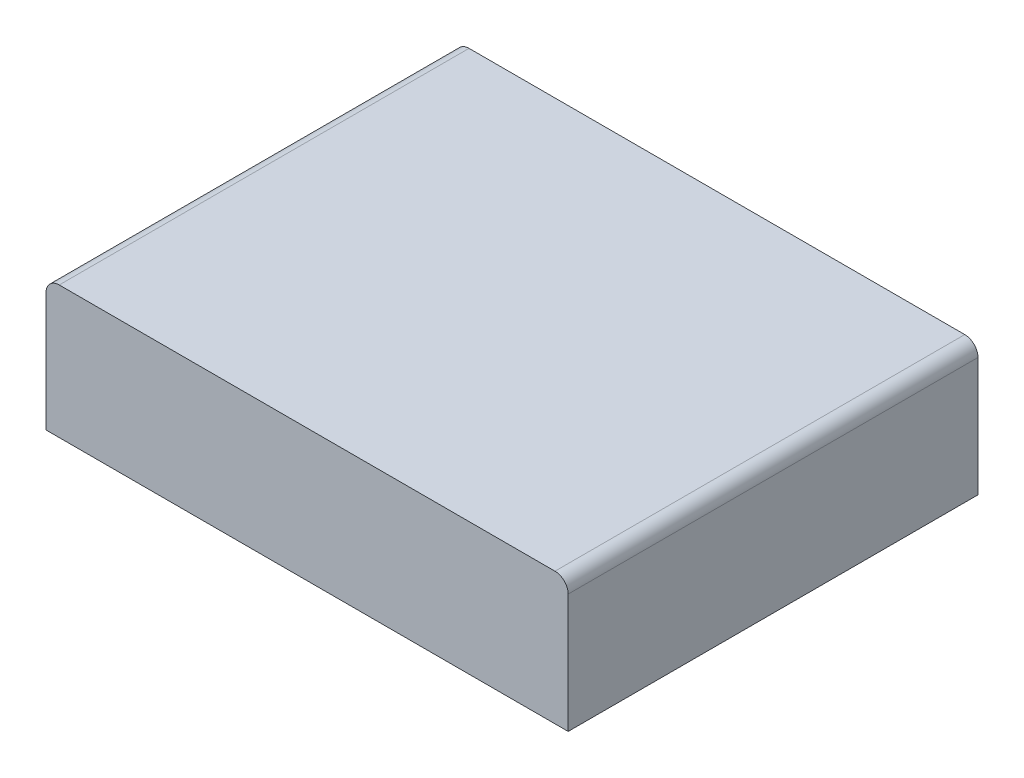
ISO-10303-21;
HEADER;
FILE_DESCRIPTION(('STEP AP214'),'2;1');
FILE_NAME('part.step','',(''),(''),'','','');
FILE_SCHEMA(('AUTOMOTIVE_DESIGN { 1 0 10303 214 1 1 1 1 }'));
ENDSEC;
DATA;
#1=APPLICATION_CONTEXT('core data for automotive mechanical design processes');
#2=APPLICATION_PROTOCOL_DEFINITION('international standard','automotive_design',2000,#1);
#3=PRODUCT_CONTEXT('',#1,'mechanical');
#4=PRODUCT('Part','Part','',(#3));
#5=PRODUCT_RELATED_PRODUCT_CATEGORY('part','',(#4));
#6=PRODUCT_DEFINITION_FORMATION('','',#4);
#7=PRODUCT_DEFINITION_CONTEXT('part definition',#1,'design');
#8=PRODUCT_DEFINITION('design','',#6,#7);
#9=PRODUCT_DEFINITION_SHAPE('','',#8);
#10=(LENGTH_UNIT() NAMED_UNIT(*) SI_UNIT(.MILLI.,.METRE.));
#11=(NAMED_UNIT(*) PLANE_ANGLE_UNIT() SI_UNIT($,.RADIAN.));
#12=(NAMED_UNIT(*) SI_UNIT($,.STERADIAN.) SOLID_ANGLE_UNIT());
#13=UNCERTAINTY_MEASURE_WITH_UNIT(LENGTH_MEASURE(1.E-05),#10,'distance_accuracy_value','');
#14=(GEOMETRIC_REPRESENTATION_CONTEXT(3) GLOBAL_UNCERTAINTY_ASSIGNED_CONTEXT((#13)) GLOBAL_UNIT_ASSIGNED_CONTEXT((#10,
#11,#12)) REPRESENTATION_CONTEXT('',''));
#15=CARTESIAN_POINT('',(0.,0.,0.));
#16=DIRECTION('',(0.,0.,1.));
#17=DIRECTION('',(1.,0.,0.));
#18=AXIS2_PLACEMENT_3D('',#15,#16,#17);
#19=CARTESIAN_POINT('',(-6.32168040793806,39.1976983767566,241.582525583809));
#20=DIRECTION('',(0.,0.,1.));
#21=DIRECTION('',(1.,0.,0.));
#22=AXIS2_PLACEMENT_3D('',#19,#20,#21);
#23=CYLINDRICAL_SURFACE('',#22,0.0508);
#24=CARTESIAN_POINT('',(-6.32168040793806,39.1976983767566,240.795125583809));
#25=DIRECTION('',(0.,0.,1.));
#26=DIRECTION('',(1.,0.,0.));
#27=AXIS2_PLACEMENT_3D('',#24,#25,#26);
#28=CIRCLE('',#27,0.0508);
#29=CARTESIAN_POINT('',(-6.32168040793806,39.2484983767566,240.795125583809));
#30=VERTEX_POINT('',#29);
#31=CARTESIAN_POINT('',(-6.37248040793806,39.1976983767566,240.795125583809));
#32=VERTEX_POINT('',#31);
#33=EDGE_CURVE('E125',#30,#32,#28,.T.);
#34=ORIENTED_EDGE('',*,*,#33,.T.);
#35=DIRECTION('',(0.,0.,-1.));
#36=VECTOR('',#35,1.);
#37=CARTESIAN_POINT('',(-6.37248040793806,39.1976983767566,242.36992558381));
#38=LINE('',#37,#36);
#39=CARTESIAN_POINT('',(-6.37248040793806,39.1976983767566,242.36992558381));
#40=VERTEX_POINT('',#39);
#41=EDGE_CURVE('E108',#32,#40,#38,.F.);
#42=ORIENTED_EDGE('',*,*,#41,.T.);
#43=CARTESIAN_POINT('',(-6.32168040793806,39.1976983767566,242.36992558381));
#44=DIRECTION('',(0.,0.,1.));
#45=DIRECTION('',(1.,0.,0.));
#46=AXIS2_PLACEMENT_3D('',#43,#44,#45);
#47=CIRCLE('',#46,0.0508);
#48=CARTESIAN_POINT('',(-6.32168040793806,39.2484983767566,242.36992558381));
#49=VERTEX_POINT('',#48);
#50=EDGE_CURVE('E20',#40,#49,#47,.F.);
#51=ORIENTED_EDGE('',*,*,#50,.T.);
#52=DIRECTION('',(0.,0.,-1.));
#53=VECTOR('',#52,1.);
#54=CARTESIAN_POINT('',(-6.32168040793806,39.2484983767566,241.582525583809));
#55=LINE('',#54,#53);
#56=EDGE_CURVE('E104',#49,#30,#55,.T.);
#57=ORIENTED_EDGE('',*,*,#56,.T.);
#58=EDGE_LOOP('',(#34,#42,#51,#57));
#59=FACE_BOUND('',#58,.T.);
#60=ADVANCED_FACE('F17',(#59),#23,.T.);
#61=CARTESIAN_POINT('',(-4.41668040793807,39.1976983767566,241.582525583809));
#62=DIRECTION('',(0.,0.,-1.));
#63=DIRECTION('',(-1.,0.,0.));
#64=AXIS2_PLACEMENT_3D('',#61,#62,#63);
#65=CYLINDRICAL_SURFACE('',#64,0.0508);
#66=CARTESIAN_POINT('',(-4.41668040793807,39.1976983767566,242.36992558381));
#67=DIRECTION('',(0.,0.,-1.));
#68=DIRECTION('',(-1.,0.,0.));
#69=AXIS2_PLACEMENT_3D('',#66,#67,#68);
#70=CIRCLE('',#69,0.0508);
#71=CARTESIAN_POINT('',(-4.41668040793807,39.2484983767566,242.36992558381));
#72=VERTEX_POINT('',#71);
#73=CARTESIAN_POINT('',(-4.36588040793806,39.1976983767566,242.36992558381));
#74=VERTEX_POINT('',#73);
#75=EDGE_CURVE('E113',#72,#74,#70,.T.);
#76=ORIENTED_EDGE('',*,*,#75,.T.);
#77=DIRECTION('',(0.,0.,1.));
#78=VECTOR('',#77,1.);
#79=CARTESIAN_POINT('',(-4.36588040793806,39.1976983767566,242.36992558381));
#80=LINE('',#79,#78);
#81=CARTESIAN_POINT('',(-4.36588040793806,39.1976983767566,240.795125583809));
#82=VERTEX_POINT('',#81);
#83=EDGE_CURVE('E100',#74,#82,#80,.F.);
#84=ORIENTED_EDGE('',*,*,#83,.T.);
#85=CARTESIAN_POINT('',(-4.41668040793807,39.1976983767566,240.795125583809));
#86=DIRECTION('',(0.,0.,-1.));
#87=DIRECTION('',(-1.,0.,0.));
#88=AXIS2_PLACEMENT_3D('',#85,#86,#87);
#89=CIRCLE('',#88,0.0508);
#90=CARTESIAN_POINT('',(-4.41668040793807,39.2484983767566,240.795125583809));
#91=VERTEX_POINT('',#90);
#92=EDGE_CURVE('E122',#82,#91,#89,.F.);
#93=ORIENTED_EDGE('',*,*,#92,.T.);
#94=DIRECTION('',(0.,0.,-1.));
#95=VECTOR('',#94,1.);
#96=CARTESIAN_POINT('',(-4.41668040793807,39.2484983767566,241.582525583809));
#97=LINE('',#96,#95);
#98=EDGE_CURVE('E109',#91,#72,#97,.F.);
#99=ORIENTED_EDGE('',*,*,#98,.T.);
#100=EDGE_LOOP('',(#76,#84,#93,#99));
#101=FACE_BOUND('',#100,.T.);
#102=ADVANCED_FACE('F161',(#101),#65,.T.);
#103=CARTESIAN_POINT('',(-5.36918040793806,39.2484983767566,241.582525583809));
#104=DIRECTION('',(0.,-1.,0.));
#105=DIRECTION('',(0.,0.,-1.));
#106=AXIS2_PLACEMENT_3D('',#103,#104,#105);
#107=PLANE('',#106);
#108=DIRECTION('',(-1.,0.,0.));
#109=VECTOR('',#108,1.);
#110=CARTESIAN_POINT('',(-6.37248040793806,39.2484983767566,242.36992558381));
#111=LINE('',#110,#109);
#112=EDGE_CURVE('E137',#49,#72,#111,.F.);
#113=ORIENTED_EDGE('',*,*,#112,.T.);
#114=ORIENTED_EDGE('',*,*,#98,.F.);
#115=DIRECTION('',(1.,0.,0.));
#116=VECTOR('',#115,1.);
#117=CARTESIAN_POINT('',(-6.37248040793806,39.2484983767566,240.795125583809));
#118=LINE('',#117,#116);
#119=EDGE_CURVE('E117',#91,#30,#118,.F.);
#120=ORIENTED_EDGE('',*,*,#119,.T.);
#121=ORIENTED_EDGE('',*,*,#56,.F.);
#122=EDGE_LOOP('',(#113,#114,#120,#121));
#123=FACE_BOUND('',#122,.T.);
#124=ADVANCED_FACE('F135',(#123),#107,.F.);
#125=CARTESIAN_POINT('',(-6.37248040793806,39.2484983767566,242.36992558381));
#126=DIRECTION('',(1.,0.,0.));
#127=DIRECTION('',(0.,0.,-1.));
#128=AXIS2_PLACEMENT_3D('',#125,#126,#127);
#129=PLANE('',#128);
#130=DIRECTION('',(0.,1.,0.));
#131=VECTOR('',#130,1.);
#132=CARTESIAN_POINT('',(-6.37248040793806,39.2484983767566,240.795125583809));
#133=LINE('',#132,#131);
#134=CARTESIAN_POINT('',(-6.37248040793806,38.7404983767566,240.795125583809));
#135=VERTEX_POINT('',#134);
#136=EDGE_CURVE('E79',#32,#135,#133,.F.);
#137=ORIENTED_EDGE('',*,*,#136,.T.);
#138=DIRECTION('',(0.,0.,-1.));
#139=VECTOR('',#138,1.);
#140=CARTESIAN_POINT('',(-6.37248040793806,38.7404983767566,241.582525583809));
#141=LINE('',#140,#139);
#142=CARTESIAN_POINT('',(-6.37248040793806,38.7404983767566,242.36992558381));
#143=VERTEX_POINT('',#142);
#144=EDGE_CURVE('E74',#143,#135,#141,.T.);
#145=ORIENTED_EDGE('',*,*,#144,.F.);
#146=DIRECTION('',(0.,1.,0.));
#147=VECTOR('',#146,1.);
#148=CARTESIAN_POINT('',(-6.37248040793806,39.2484983767566,242.36992558381));
#149=LINE('',#148,#147);
#150=EDGE_CURVE('E77',#143,#40,#149,.T.);
#151=ORIENTED_EDGE('',*,*,#150,.T.);
#152=ORIENTED_EDGE('',*,*,#41,.F.);
#153=EDGE_LOOP('',(#137,#145,#151,#152));
#154=FACE_BOUND('',#153,.T.);
#155=ADVANCED_FACE('F75',(#154),#129,.F.);
#156=CARTESIAN_POINT('',(-6.37248040793806,39.2484983767566,240.795125583809));
#157=DIRECTION('',(0.,0.,1.));
#158=DIRECTION('',(1.,0.,0.));
#159=AXIS2_PLACEMENT_3D('',#156,#157,#158);
#160=PLANE('',#159);
#161=ORIENTED_EDGE('',*,*,#119,.F.);
#162=ORIENTED_EDGE('',*,*,#92,.F.);
#163=DIRECTION('',(0.,1.,0.));
#164=VECTOR('',#163,1.);
#165=CARTESIAN_POINT('',(-4.36588040793806,39.2484983767566,240.795125583809));
#166=LINE('',#165,#164);
#167=CARTESIAN_POINT('',(-4.36588040793806,38.7404983767566,240.795125583809));
#168=VERTEX_POINT('',#167);
#169=EDGE_CURVE('E114',#82,#168,#166,.F.);
#170=ORIENTED_EDGE('',*,*,#169,.T.);
#171=DIRECTION('',(1.,0.,0.));
#172=VECTOR('',#171,1.);
#173=CARTESIAN_POINT('',(-5.36918040793806,38.7404983767566,240.795125583809));
#174=LINE('',#173,#172);
#175=EDGE_CURVE('E84',#135,#168,#174,.T.);
#176=ORIENTED_EDGE('',*,*,#175,.F.);
#177=ORIENTED_EDGE('',*,*,#136,.F.);
#178=ORIENTED_EDGE('',*,*,#33,.F.);
#179=EDGE_LOOP('',(#161,#162,#170,#176,#177,#178));
#180=FACE_BOUND('',#179,.T.);
#181=ADVANCED_FACE('F164',(#180),#160,.F.);
#182=CARTESIAN_POINT('',(-4.36588040793806,39.2484983767566,242.36992558381));
#183=DIRECTION('',(-1.,0.,0.));
#184=DIRECTION('',(0.,0.,1.));
#185=AXIS2_PLACEMENT_3D('',#182,#183,#184);
#186=PLANE('',#185);
#187=DIRECTION('',(0.,1.,0.));
#188=VECTOR('',#187,1.);
#189=CARTESIAN_POINT('',(-4.36588040793806,39.2484983767566,242.36992558381));
#190=LINE('',#189,#188);
#191=CARTESIAN_POINT('',(-4.36588040793806,38.7404983767566,242.36992558381));
#192=VERTEX_POINT('',#191);
#193=EDGE_CURVE('E36',#74,#192,#190,.F.);
#194=ORIENTED_EDGE('',*,*,#193,.T.);
#195=DIRECTION('',(0.,0.,-1.));
#196=VECTOR('',#195,1.);
#197=CARTESIAN_POINT('',(-4.36588040793806,38.7404983767566,241.582525583809));
#198=LINE('',#197,#196);
#199=EDGE_CURVE('E27',#168,#192,#198,.F.);
#200=ORIENTED_EDGE('',*,*,#199,.F.);
#201=ORIENTED_EDGE('',*,*,#169,.F.);
#202=ORIENTED_EDGE('',*,*,#83,.F.);
#203=EDGE_LOOP('',(#194,#200,#201,#202));
#204=FACE_BOUND('',#203,.T.);
#205=ADVANCED_FACE('F162',(#204),#186,.F.);
#206=CARTESIAN_POINT('',(-6.37248040793806,39.2484983767566,242.36992558381));
#207=DIRECTION('',(0.,0.,-1.));
#208=DIRECTION('',(-1.,0.,0.));
#209=AXIS2_PLACEMENT_3D('',#206,#207,#208);
#210=PLANE('',#209);
#211=ORIENTED_EDGE('',*,*,#150,.F.);
#212=DIRECTION('',(1.,0.,0.));
#213=VECTOR('',#212,1.);
#214=CARTESIAN_POINT('',(-5.36918040793806,38.7404983767566,242.36992558381));
#215=LINE('',#214,#213);
#216=EDGE_CURVE('E11',#192,#143,#215,.F.);
#217=ORIENTED_EDGE('',*,*,#216,.F.);
#218=ORIENTED_EDGE('',*,*,#193,.F.);
#219=ORIENTED_EDGE('',*,*,#75,.F.);
#220=ORIENTED_EDGE('',*,*,#112,.F.);
#221=ORIENTED_EDGE('',*,*,#50,.F.);
#222=EDGE_LOOP('',(#211,#217,#218,#219,#220,#221));
#223=FACE_BOUND('',#222,.T.);
#224=ADVANCED_FACE('F86',(#223),#210,.F.);
#225=CARTESIAN_POINT('',(-5.36918040793806,38.7404983767566,241.582525583809));
#226=DIRECTION('',(0.,-1.,0.));
#227=DIRECTION('',(0.,0.,-1.));
#228=AXIS2_PLACEMENT_3D('',#225,#226,#227);
#229=PLANE('',#228);
#230=ORIENTED_EDGE('',*,*,#199,.T.);
#231=ORIENTED_EDGE('',*,*,#216,.T.);
#232=ORIENTED_EDGE('',*,*,#144,.T.);
#233=ORIENTED_EDGE('',*,*,#175,.T.);
#234=EDGE_LOOP('',(#230,#231,#232,#233));
#235=FACE_BOUND('',#234,.T.);
#236=ADVANCED_FACE('F90',(#235),#229,.T.);
#237=CLOSED_SHELL('',(#60,#102,#124,#155,#181,#205,#224,#236));
#238=MANIFOLD_SOLID_BREP('B1',#237);
#239=ADVANCED_BREP_SHAPE_REPRESENTATION('',(#18,#238),#14);
#240=SHAPE_DEFINITION_REPRESENTATION(#9,#239);
ENDSEC;
END-ISO-10303-21;
